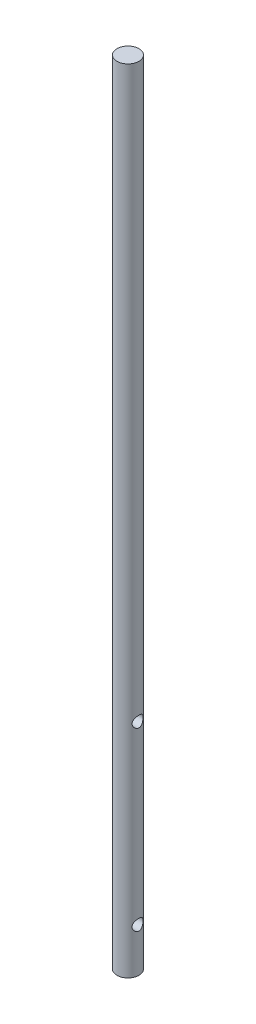
ISO-10303-21;
HEADER;
FILE_DESCRIPTION(('STEP AP214'),'2;1');
FILE_NAME('part.step','',(''),(''),'','','');
FILE_SCHEMA(('AUTOMOTIVE_DESIGN { 1 0 10303 214 1 1 1 1 }'));
ENDSEC;
DATA;
#1=APPLICATION_CONTEXT('core data for automotive mechanical design processes');
#2=APPLICATION_PROTOCOL_DEFINITION('international standard','automotive_design',2000,#1);
#3=PRODUCT_CONTEXT('',#1,'mechanical');
#4=PRODUCT('Part','Part','',(#3));
#5=PRODUCT_RELATED_PRODUCT_CATEGORY('part','',(#4));
#6=PRODUCT_DEFINITION_FORMATION('','',#4);
#7=PRODUCT_DEFINITION_CONTEXT('part definition',#1,'design');
#8=PRODUCT_DEFINITION('design','',#6,#7);
#9=PRODUCT_DEFINITION_SHAPE('','',#8);
#10=(LENGTH_UNIT() NAMED_UNIT(*) SI_UNIT(.MILLI.,.METRE.));
#11=(NAMED_UNIT(*) PLANE_ANGLE_UNIT() SI_UNIT($,.RADIAN.));
#12=(NAMED_UNIT(*) SI_UNIT($,.STERADIAN.) SOLID_ANGLE_UNIT());
#13=UNCERTAINTY_MEASURE_WITH_UNIT(LENGTH_MEASURE(1.E-05),#10,'distance_accuracy_value','');
#14=(GEOMETRIC_REPRESENTATION_CONTEXT(3) GLOBAL_UNCERTAINTY_ASSIGNED_CONTEXT((#13)) GLOBAL_UNIT_ASSIGNED_CONTEXT((#10,
#11,#12)) REPRESENTATION_CONTEXT('',''));
#15=CARTESIAN_POINT('',(0.,0.,0.));
#16=DIRECTION('',(0.,0.,1.));
#17=DIRECTION('',(1.,0.,0.));
#18=AXIS2_PLACEMENT_3D('',#15,#16,#17);
#19=CARTESIAN_POINT('',(0.,457.2,0.));
#20=DIRECTION('',(0.,-1.,0.));
#21=DIRECTION('',(0.,0.,-1.));
#22=AXIS2_PLACEMENT_3D('',#19,#20,#21);
#23=CYLINDRICAL_SURFACE('',#22,6.35);
#24=CARTESIAN_POINT('',(-5.49926131403118,127.,-3.175));
#25=CARTESIAN_POINT('',(-5.49926232876913,127.082761913533,-3.17499905676822));
#26=CARTESIAN_POINT('',(-5.50113815093942,127.165533915042,-3.17175738528249));
#27=CARTESIAN_POINT('',(-5.50856077670455,127.330420212859,-3.15884523354688));
#28=CARTESIAN_POINT('',(-5.51410928932437,127.412534184951,-3.1491717603564));
#29=CARTESIAN_POINT('',(-5.53601678924102,127.657165748411,-3.11062065473092));
#30=CARTESIAN_POINT('',(-5.55763722742636,127.817828046981,-3.07221261154103));
#31=CARTESIAN_POINT('',(-5.61178865498313,128.128597812146,-2.97211747978078));
#32=CARTESIAN_POINT('',(-5.6442615458663,128.278756440186,-2.9105541372517));
#33=CARTESIAN_POINT('',(-5.71635543890045,128.5666114228,-2.76627435445934));
#34=CARTESIAN_POINT('',(-5.75597682772093,128.704307102634,-2.6835567698406));
#35=CARTESIAN_POINT('',(-5.84190034267495,128.97582382134,-2.49131627779833));
#36=CARTESIAN_POINT('',(-5.8884839533831,129.108388597282,-2.38014521787041));
#37=CARTESIAN_POINT('',(-5.98081052060146,129.353970791255,-2.13758083606041));
#38=CARTESIAN_POINT('',(-6.02655304768282,129.466978458905,-2.00617748851799));
#39=CARTESIAN_POINT('',(-6.11573187346573,129.67769095285,-1.71605436473861));
#40=CARTESIAN_POINT('',(-6.15880487346127,129.77385077894,-1.556090325276));
#41=CARTESIAN_POINT('',(-6.2341365114724,129.937322143111,-1.2196985592924));
#42=CARTESIAN_POINT('',(-6.26640197156109,130.004651887186,-1.04328130884116));
#43=CARTESIAN_POINT('',(-6.31445464313237,130.103577314539,-0.692292696730367));
#44=CARTESIAN_POINT('',(-6.33125099630315,130.137374746794,-0.518483183758143));
#45=CARTESIAN_POINT('',(-6.35024078782237,130.175527426178,-0.166911747158822));
#46=CARTESIAN_POINT('',(-6.35244306187831,130.179900487757,0.0108477196167096));
#47=CARTESIAN_POINT('',(-6.34247467450733,130.159929298795,0.348718268640241));
#48=CARTESIAN_POINT('',(-6.33153724004096,130.138049256784,0.509019820270716));
#49=CARTESIAN_POINT('',(-6.29838229153244,130.070603364542,0.823321212955352));
#50=CARTESIAN_POINT('',(-6.27616393341038,130.025035741913,0.977320581525282));
#51=CARTESIAN_POINT('',(-6.22209775234818,129.911212685977,1.27733236684467));
#52=CARTESIAN_POINT('',(-6.19012095460315,129.842652079479,1.42320480220677));
#53=CARTESIAN_POINT('',(-6.11942032404916,129.685214279984,1.70172616219332));
#54=CARTESIAN_POINT('',(-6.08069407688628,129.596329813352,1.83437032813195));
#55=CARTESIAN_POINT('',(-5.99580926070807,129.391104698414,2.09605211974367));
#56=CARTESIAN_POINT('',(-5.94929416927822,129.272962909571,2.22356359612798));
#57=CARTESIAN_POINT('',(-5.85642633307517,129.01743760648,2.45777846555887));
#58=CARTESIAN_POINT('',(-5.81007373990265,128.88003942646,2.56446584928023));
#59=CARTESIAN_POINT('',(-5.71957289604347,128.579052231631,2.76069102698818));
#60=CARTESIAN_POINT('',(-5.67575155752789,128.414354088941,2.84870951352547));
#61=CARTESIAN_POINT('',(-5.61885247415838,128.156162433869,2.95849503046443));
#62=CARTESIAN_POINT('',(-5.60135560040996,128.068222071488,2.99138760520285));
#63=CARTESIAN_POINT('',(-5.56999217748626,127.889202561789,3.04938956554735));
#64=CARTESIAN_POINT('',(-5.55612339050229,127.798125388681,3.07450375064138));
#65=CARTESIAN_POINT('',(-5.53355357587716,127.620848368596,3.11492823782859));
#66=CARTESIAN_POINT('',(-5.52453156228568,127.534829357867,3.13085491331031));
#67=CARTESIAN_POINT('',(-5.51045313491466,127.361489372412,3.15556797554225));
#68=CARTESIAN_POINT('',(-5.50539465890766,127.274169098866,3.16435807553686));
#69=CARTESIAN_POINT('',(-5.49945626530651,127.098984851134,3.17466835867006));
#70=CARTESIAN_POINT('',(-5.49857479177741,127.01112109161,3.17619124884848));
#71=CARTESIAN_POINT('',(-5.50101508803298,126.835655162357,3.17195985852084));
#72=CARTESIAN_POINT('',(-5.50433657410105,126.748052975372,3.16620606921981));
#73=CARTESIAN_POINT('',(-5.51925588435845,126.505907414355,3.14018226453033));
#74=CARTESIAN_POINT('',(-5.53528611699028,126.352394392471,3.11209439281023));
#75=CARTESIAN_POINT('',(-5.57828096923594,126.052653119407,3.03433762958357));
#76=CARTESIAN_POINT('',(-5.60524912972111,125.90642724448,2.98466174914481));
#77=CARTESIAN_POINT('',(-5.6685262578896,125.617577373351,2.86273054239683));
#78=CARTESIAN_POINT('',(-5.70520999770141,125.475433867968,2.78953600385259));
#79=CARTESIAN_POINT('',(-5.78345646913641,125.204632815229,2.62346157669831));
#80=CARTESIAN_POINT('',(-5.82502170218952,125.075982246558,2.53057157570875));
#81=CARTESIAN_POINT('',(-5.91464405440153,124.818843128481,2.31405795861386));
#82=CARTESIAN_POINT('',(-5.96285904289681,124.692419238297,2.18803622695197));
#83=CARTESIAN_POINT('',(-6.05581193279061,124.46186595248,1.91580928554185));
#84=CARTESIAN_POINT('',(-6.10054865642871,124.357744087677,1.7695972853741));
#85=CARTESIAN_POINT('',(-6.18303824145363,124.172428473318,1.45584977269241));
#86=CARTESIAN_POINT('',(-6.22057562531784,124.091912363174,1.28785333421911));
#87=CARTESIAN_POINT('',(-6.28279651772886,123.961087141771,0.938283508313593));
#88=CARTESIAN_POINT('',(-6.30749131056505,123.910751506126,0.756722200806227));
#89=CARTESIAN_POINT('',(-6.33944338582815,123.84605480946,0.403160492410768));
#90=CARTESIAN_POINT('',(-6.34809271326659,123.828816735698,0.231811338563315));
#91=CARTESIAN_POINT('',(-6.35133763722966,123.822322640575,-0.111525009731701));
#92=CARTESIAN_POINT('',(-6.3459381534549,123.833056823714,-0.283511959769329));
#93=CARTESIAN_POINT('',(-6.32250351776756,123.880297059558,-0.611308110350763));
#94=CARTESIAN_POINT('',(-6.30532443151585,123.915058279863,-0.767436553820521));
#95=CARTESIAN_POINT('',(-6.26084894800281,124.007013339334,-1.07139095342118));
#96=CARTESIAN_POINT('',(-6.23355109988091,124.064210395491,-1.21921571544175));
#97=CARTESIAN_POINT('',(-6.16984840144776,124.201957937862,-1.50946910032134));
#98=CARTESIAN_POINT('',(-6.13310397734645,124.283402628126,-1.65139651176321));
#99=CARTESIAN_POINT('',(-6.05434784579293,124.466218154329,-1.92016030444464));
#100=CARTESIAN_POINT('',(-6.01233372232389,124.567598142255,-2.04698971133068));
#101=CARTESIAN_POINT('',(-5.92228494250573,124.799073831295,-2.29524860659571));
#102=CARTESIAN_POINT('',(-5.87406724075614,124.931023231152,-2.41488454123003));
#103=CARTESIAN_POINT('',(-5.78049654064408,125.213933730541,-2.63101905620373));
#104=CARTESIAN_POINT('',(-5.73514610261339,125.364911471258,-2.72749716677431));
#105=CARTESIAN_POINT('',(-5.67271720109895,125.605679481244,-2.85396050304136));
#106=CARTESIAN_POINT('',(-5.6525712359879,125.689757722706,-2.89354057606827));
#107=CARTESIAN_POINT('',(-5.61522862075768,125.861607224518,-2.9653574765472));
#108=CARTESIAN_POINT('',(-5.59803045260694,125.949376554883,-2.99759808643802));
#109=CARTESIAN_POINT('',(-5.56731186793829,126.127769008425,-3.05427194354531));
#110=CARTESIAN_POINT('',(-5.55378200380455,126.21838411683,-3.07872527562276));
#111=CARTESIAN_POINT('',(-5.53094387019911,126.401888478541,-3.11956903021309));
#112=CARTESIAN_POINT('',(-5.52163264949545,126.494776093974,-3.13596509002516));
#113=CARTESIAN_POINT('',(-5.50956192150408,126.656463748796,-3.15710761797221));
#114=CARTESIAN_POINT('',(-5.5057086840578,126.72493367276,-3.16381073091702));
#115=CARTESIAN_POINT('',(-5.50055787263126,126.862266718613,-3.17275746355016));
#116=CARTESIAN_POINT('',(-5.49926046961937,126.931129866497,-3.17500078490812));
#117=CARTESIAN_POINT('',(-5.49926131403118,127.,-3.175));
#118=B_SPLINE_CURVE_WITH_KNOTS('',3,(#24,#25,#26,#27,#28,#29,#30,#31,#32,#33,#34,#35,#36,#37,
#38,#39,#40,#41,#42,#43,#44,#45,#46,#47,#48,#49,#50,#51,#52,#53,#54,#55,#56,#57,#58,#59,#60,#61,
#62,#63,#64,#65,#66,#67,#68,#69,#70,#71,#72,#73,#74,#75,#76,#77,#78,#79,#80,#81,#82,#83,#84,#85,
#86,#87,#88,#89,#90,#91,#92,#93,#94,#95,#96,#97,#98,#99,#100,#101,#102,#103,#104,#105,#106,#107,
#108,#109,#110,#111,#112,#113,#114,#115,#116,#117),.UNSPECIFIED.,.T.,.F.,(4,2,2,2,2,2,2,2,2,2,2,
2,2,2,2,2,2,2,2,2,2,2,2,2,2,2,2,2,2,2,2,2,2,2,2,2,2,2,2,2,2,2,2,2,2,2,4),(0.,0.248210314193387,
0.496536210172837,0.993616655653378,1.48807751301481,1.98256512428755,2.51783706318111,
3.05337510292799,3.62501229957996,4.19628797710276,4.72691486873116,5.25722047303098,
5.7414103161333,6.2256363934284,6.71656194871309,7.20766347537033,7.74518754975547,
8.2831232528071,8.85521994590919,9.14138502893472,9.42737318655796,9.69083660833534,
9.95416285897607,10.2173910127766,10.4806013985705,10.9489167635525,11.4173838546847,
11.907548100733,12.3979646273262,12.9502005485241,13.5026226528976,14.0696241997013,
14.6361266987681,15.1506510247059,15.6649951955482,16.1454469295095,16.6259675788461,
17.1270402751829,17.6283435455375,18.1795366185793,18.7312151251733,19.0161455987001,
19.300928897391,19.5849716229022,19.8688153329579,20.075349152287,20.2818967868888),.UNSPECIFIED.);
#119=CARTESIAN_POINT('',(-5.49926131403118,127.,-3.175));
#120=VERTEX_POINT('',#119);
#121=EDGE_CURVE('E10',#120,#120,#118,.T.);
#122=ORIENTED_EDGE('',*,*,#121,.T.);
#123=EDGE_LOOP('',(#122));
#124=FACE_BOUND('',#123,.T.);
#125=CARTESIAN_POINT('',(5.49926131403119,127.,-3.175));
#126=CARTESIAN_POINT('',(5.49926232876913,126.917238086467,-3.17499905676822));
#127=CARTESIAN_POINT('',(5.50113815093942,126.834466084958,-3.17175738528249));
#128=CARTESIAN_POINT('',(5.50856077670455,126.669579787141,-3.15884523354688));
#129=CARTESIAN_POINT('',(5.51410928932437,126.587465815049,-3.1491717603564));
#130=CARTESIAN_POINT('',(5.53601678924102,126.342834251589,-3.11062065473092));
#131=CARTESIAN_POINT('',(5.55763722742636,126.182171953019,-3.07221261154103));
#132=CARTESIAN_POINT('',(5.61178865498313,125.871402187854,-2.97211747978078));
#133=CARTESIAN_POINT('',(5.6442615458663,125.721243559814,-2.9105541372517));
#134=CARTESIAN_POINT('',(5.71635543890045,125.4333885772,-2.76627435445935));
#135=CARTESIAN_POINT('',(5.75597682772092,125.295692897366,-2.68355676984061));
#136=CARTESIAN_POINT('',(5.84190034267495,125.02417617866,-2.49131627779835));
#137=CARTESIAN_POINT('',(5.88848395338309,124.891611402718,-2.38014521787044));
#138=CARTESIAN_POINT('',(5.98081052060145,124.646029208745,-2.13758083606044));
#139=CARTESIAN_POINT('',(6.02655304768281,124.533021541095,-2.00617748851802));
#140=CARTESIAN_POINT('',(6.11573187346572,124.32230904715,-1.71605436473864));
#141=CARTESIAN_POINT('',(6.15880487346126,124.22614922106,-1.55609032527603));
#142=CARTESIAN_POINT('',(6.23413651147239,124.062677856889,-1.21969855929245));
#143=CARTESIAN_POINT('',(6.26640197156108,123.995348112814,-1.04328130884121));
#144=CARTESIAN_POINT('',(6.31445464313236,123.896422685461,-0.69229269673042));
#145=CARTESIAN_POINT('',(6.33125099630315,123.862625253206,-0.518483183758195));
#146=CARTESIAN_POINT('',(6.35024078782237,123.824472573822,-0.16691174715887));
#147=CARTESIAN_POINT('',(6.35244306187831,123.820099512243,0.0108477196166665));
#148=CARTESIAN_POINT('',(6.34247467450733,123.840070701205,0.348718268640203));
#149=CARTESIAN_POINT('',(6.33153724004097,123.861950743216,0.509019820270679));
#150=CARTESIAN_POINT('',(6.29838229153245,123.929396635458,0.823321212955321));
#151=CARTESIAN_POINT('',(6.27616393341038,123.974964258087,0.977320581525257));
#152=CARTESIAN_POINT('',(6.22209775234818,124.088787314023,1.27733236684466));
#153=CARTESIAN_POINT('',(6.19012095460315,124.157347920521,1.42320480220676));
#154=CARTESIAN_POINT('',(6.11942032404916,124.314785720016,1.70172616219331));
#155=CARTESIAN_POINT('',(6.08069407688628,124.403670186648,1.83437032813194));
#156=CARTESIAN_POINT('',(5.99580926070808,124.608895301586,2.09605211974366));
#157=CARTESIAN_POINT('',(5.94929416927823,124.727037090429,2.22356359612797));
#158=CARTESIAN_POINT('',(5.85642633307518,124.98256239352,2.45777846555886));
#159=CARTESIAN_POINT('',(5.81007373990265,125.11996057354,2.56446584928023));
#160=CARTESIAN_POINT('',(5.71957289604347,125.420947768369,2.76069102698818));
#161=CARTESIAN_POINT('',(5.67575155752789,125.585645911059,2.84870951352547));
#162=CARTESIAN_POINT('',(5.61885247415838,125.843837566131,2.95849503046443));
#163=CARTESIAN_POINT('',(5.60135560040996,125.931777928512,2.99138760520285));
#164=CARTESIAN_POINT('',(5.56999217748626,126.110797438211,3.04938956554735));
#165=CARTESIAN_POINT('',(5.55612339050229,126.201874611319,3.07450375064138));
#166=CARTESIAN_POINT('',(5.53355357587716,126.379151631404,3.11492823782859));
#167=CARTESIAN_POINT('',(5.52453156228568,126.465170642133,3.13085491331031));
#168=CARTESIAN_POINT('',(5.51045313491466,126.638510627588,3.15556797554225));
#169=CARTESIAN_POINT('',(5.50539465890766,126.725830901134,3.16435807553686));
#170=CARTESIAN_POINT('',(5.49945626530651,126.901015148866,3.17466835867006));
#171=CARTESIAN_POINT('',(5.49857479177741,126.98887890839,3.17619124884848));
#172=CARTESIAN_POINT('',(5.50101508803298,127.164344837643,3.17195985852084));
#173=CARTESIAN_POINT('',(5.50433657410105,127.251947024628,3.16620606921981));
#174=CARTESIAN_POINT('',(5.51925588435845,127.494092585645,3.14018226453034));
#175=CARTESIAN_POINT('',(5.53528611699027,127.647605607529,3.11209439281024));
#176=CARTESIAN_POINT('',(5.57828096923592,127.947346880593,3.0343376295836));
#177=CARTESIAN_POINT('',(5.60524912972109,128.09357275552,2.98466174914484));
#178=CARTESIAN_POINT('',(5.66852625788959,128.382422626649,2.86273054239686));
#179=CARTESIAN_POINT('',(5.70520999770139,128.524566132032,2.78953600385262));
#180=CARTESIAN_POINT('',(5.7834564691364,128.795367184771,2.62346157669834));
#181=CARTESIAN_POINT('',(5.8250217021895,128.924017753442,2.53057157570878));
#182=CARTESIAN_POINT('',(5.91464405440152,129.181156871519,2.31405795861388));
#183=CARTESIAN_POINT('',(5.96285904289681,129.307580761703,2.18803622695198));
#184=CARTESIAN_POINT('',(6.0558119327906,129.53813404752,1.91580928554186));
#185=CARTESIAN_POINT('',(6.10054865642871,129.642255912323,1.76959728537412));
#186=CARTESIAN_POINT('',(6.18303824145362,129.827571526682,1.45584977269244));
#187=CARTESIAN_POINT('',(6.22057562531784,129.908087636826,1.28785333421913));
#188=CARTESIAN_POINT('',(6.28279651772886,130.038912858229,0.938283508313602));
#189=CARTESIAN_POINT('',(6.30749131056505,130.089248493874,0.756722200806234));
#190=CARTESIAN_POINT('',(6.33944338582815,130.15394519054,0.403160492410776));
#191=CARTESIAN_POINT('',(6.34809271326659,130.171183264302,0.231811338563327));
#192=CARTESIAN_POINT('',(6.35133763722966,130.177677359425,-0.111525009731683));
#193=CARTESIAN_POINT('',(6.3459381534549,130.166943176286,-0.283511959769307));
#194=CARTESIAN_POINT('',(6.32250351776756,130.119702940442,-0.61130811035074));
#195=CARTESIAN_POINT('',(6.30532443151586,130.084941720137,-0.767436553820498));
#196=CARTESIAN_POINT('',(6.26084894800281,129.992986660666,-1.07139095342115));
#197=CARTESIAN_POINT('',(6.23355109988092,129.935789604509,-1.21921571544172));
#198=CARTESIAN_POINT('',(6.16984840144777,129.798042062138,-1.5094691003213));
#199=CARTESIAN_POINT('',(6.13310397734646,129.716597371874,-1.65139651176318));
#200=CARTESIAN_POINT('',(6.05434784579294,129.533781845671,-1.92016030444461));
#201=CARTESIAN_POINT('',(6.0123337223239,129.432401857745,-2.04698971133065));
#202=CARTESIAN_POINT('',(5.92228494250574,129.200926168705,-2.29524860659568));
#203=CARTESIAN_POINT('',(5.87406724075615,129.068976768848,-2.41488454123001));
#204=CARTESIAN_POINT('',(5.78049654064409,128.786066269459,-2.63101905620371));
#205=CARTESIAN_POINT('',(5.7351461026134,128.635088528742,-2.72749716677428));
#206=CARTESIAN_POINT('',(5.67271720109896,128.394320518756,-2.85396050304133));
#207=CARTESIAN_POINT('',(5.65257123598791,128.310242277294,-2.89354057606825));
#208=CARTESIAN_POINT('',(5.61522862075769,128.138392775482,-2.96535747654717));
#209=CARTESIAN_POINT('',(5.59803045260695,128.050623445117,-2.997598086438));
#210=CARTESIAN_POINT('',(5.5673118679383,127.872230991575,-3.05427194354529));
#211=CARTESIAN_POINT('',(5.55378200380455,127.78161588317,-3.07872527562275));
#212=CARTESIAN_POINT('',(5.53094387019911,127.598111521459,-3.11956903021308));
#213=CARTESIAN_POINT('',(5.52163264949546,127.505223906026,-3.13596509002515));
#214=CARTESIAN_POINT('',(5.50956192150408,127.343536251204,-3.15710761797221));
#215=CARTESIAN_POINT('',(5.5057086840578,127.27506632724,-3.16381073091702));
#216=CARTESIAN_POINT('',(5.50055787263126,127.137733281387,-3.17275746355016));
#217=CARTESIAN_POINT('',(5.49926046961937,127.068870133503,-3.17500078490812));
#218=CARTESIAN_POINT('',(5.49926131403119,127.,-3.175));
#219=B_SPLINE_CURVE_WITH_KNOTS('',3,(#125,#126,#127,#128,#129,#130,#131,#132,#133,#134,#135,
#136,#137,#138,#139,#140,#141,#142,#143,#144,#145,#146,#147,#148,#149,#150,#151,#152,#153,#154,
#155,#156,#157,#158,#159,#160,#161,#162,#163,#164,#165,#166,#167,#168,#169,#170,#171,#172,#173,
#174,#175,#176,#177,#178,#179,#180,#181,#182,#183,#184,#185,#186,#187,#188,#189,#190,#191,#192,
#193,#194,#195,#196,#197,#198,#199,#200,#201,#202,#203,#204,#205,#206,#207,#208,#209,#210,#211,
#212,#213,#214,#215,#216,#217,#218),.UNSPECIFIED.,.T.,.F.,(4,2,2,2,2,2,2,2,2,2,2,2,2,2,2,2,2,2,
2,2,2,2,2,2,2,2,2,2,2,2,2,2,2,2,2,2,2,2,2,2,2,2,2,2,2,2,4),(0.,0.248210314193387,
0.496536210172837,0.993616655653378,1.48807751301481,1.98256512428751,2.51783706318106,
3.05337510292795,3.62501229957991,4.1962879771027,4.72691486873111,5.25722047303094,
5.74141031613326,6.22563639342837,6.71656194871309,7.20766347537031,7.74518754975545,
8.28312325280709,8.85521994590918,9.14138502893472,9.42737318655796,9.69083660833534,
9.95416285897606,10.2173910127766,10.4806013985705,10.9489167635524,11.4173838546846,
11.9075481007329,12.3979646273261,12.9502005485241,13.5026226528975,14.0696241997013,
14.6361266987681,15.1506510247058,15.6649951955482,16.1454469295095,16.625967578846,
17.1270402751829,17.6283435455375,18.1795366185792,18.7312151251733,19.0161455987001,
19.3009288973909,19.5849716229022,19.8688153329579,20.0753491522871,20.2818967868888),.UNSPECIFIED.);
#220=CARTESIAN_POINT('',(5.49926131403119,127.,-3.175));
#221=VERTEX_POINT('',#220);
#222=EDGE_CURVE('E41',#221,#221,#219,.T.);
#223=ORIENTED_EDGE('',*,*,#222,.T.);
#224=EDGE_LOOP('',(#223));
#225=FACE_BOUND('',#224,.T.);
#226=CARTESIAN_POINT('',(-5.49926131403118,25.4,-3.175));
#227=CARTESIAN_POINT('',(-5.49926232876913,25.4827619135325,-3.17499905676822));
#228=CARTESIAN_POINT('',(-5.50113815093942,25.5655339150417,-3.17175738528249));
#229=CARTESIAN_POINT('',(-5.50856077670455,25.7304202128587,-3.15884523354688));
#230=CARTESIAN_POINT('',(-5.51410928932437,25.8125341849508,-3.1491717603564));
#231=CARTESIAN_POINT('',(-5.53601678924102,26.0571657484108,-3.11062065473092));
#232=CARTESIAN_POINT('',(-5.55763722742636,26.217828046981,-3.07221261154103));
#233=CARTESIAN_POINT('',(-5.61178865498313,26.5285978121458,-2.97211747978078));
#234=CARTESIAN_POINT('',(-5.6442615458663,26.6787564401864,-2.91055413725169));
#235=CARTESIAN_POINT('',(-5.71635543890046,26.9666114228,-2.76627435445934));
#236=CARTESIAN_POINT('',(-5.75597682772093,27.1043071026343,-2.6835567698406));
#237=CARTESIAN_POINT('',(-5.84190034267495,27.3758238213397,-2.49131627779834));
#238=CARTESIAN_POINT('',(-5.8884839533831,27.5083885972817,-2.38014521787042));
#239=CARTESIAN_POINT('',(-5.98081052060146,27.7539707912548,-2.13758083606041));
#240=CARTESIAN_POINT('',(-6.02655304768282,27.866978458905,-2.00617748851799));
#241=CARTESIAN_POINT('',(-6.11573187346573,28.0776909528501,-1.7160543647386));
#242=CARTESIAN_POINT('',(-6.15880487346127,28.1738507789397,-1.55609032527599));
#243=CARTESIAN_POINT('',(-6.2341365114724,28.3373221431114,-1.2196985592924));
#244=CARTESIAN_POINT('',(-6.26640197156109,28.404651887186,-1.04328130884116));
#245=CARTESIAN_POINT('',(-6.31445464313237,28.5035773145385,-0.692292696730367));
#246=CARTESIAN_POINT('',(-6.33125099630315,28.5373747467942,-0.518483183758143));
#247=CARTESIAN_POINT('',(-6.35024078782237,28.5755274261782,-0.166911747158821));
#248=CARTESIAN_POINT('',(-6.35244306187831,28.5799004877566,0.0108477196167126));
#249=CARTESIAN_POINT('',(-6.34247467450733,28.5599292987948,0.348718268640244));
#250=CARTESIAN_POINT('',(-6.33153724004096,28.5380492567841,0.509019820270719));
#251=CARTESIAN_POINT('',(-6.29838229153244,28.470603364542,0.823321212955356));
#252=CARTESIAN_POINT('',(-6.27616393341038,28.4250357419134,0.977320581525289));
#253=CARTESIAN_POINT('',(-6.22209775234818,28.3112126859772,1.27733236684468));
#254=CARTESIAN_POINT('',(-6.19012095460315,28.2426520794793,1.42320480220678));
#255=CARTESIAN_POINT('',(-6.11942032404915,28.0852142799841,1.70172616219333));
#256=CARTESIAN_POINT('',(-6.08069407688628,27.9963298133523,1.83437032813196));
#257=CARTESIAN_POINT('',(-5.99580926070807,27.791104698414,2.09605211974368));
#258=CARTESIAN_POINT('',(-5.94929416927822,27.6729629095709,2.22356359612798));
#259=CARTESIAN_POINT('',(-5.85642633307517,27.4174376064798,2.45777846555888));
#260=CARTESIAN_POINT('',(-5.81007373990264,27.2800394264604,2.56446584928025));
#261=CARTESIAN_POINT('',(-5.71957289604346,26.9790522316311,2.76069102698819));
#262=CARTESIAN_POINT('',(-5.67575155752788,26.8143540889413,2.84870951352548));
#263=CARTESIAN_POINT('',(-5.61885247415838,26.5561624338692,2.95849503046444));
#264=CARTESIAN_POINT('',(-5.60135560040996,26.4682220714883,2.99138760520286));
#265=CARTESIAN_POINT('',(-5.56999217748626,26.2892025617885,3.04938956554736));
#266=CARTESIAN_POINT('',(-5.55612339050229,26.1981253886808,3.07450375064138));
#267=CARTESIAN_POINT('',(-5.53355357587715,26.0208483685962,3.11492823782859));
#268=CARTESIAN_POINT('',(-5.52453156228567,25.9348293578666,3.13085491331032));
#269=CARTESIAN_POINT('',(-5.51045313491466,25.7614893724119,3.15556797554225));
#270=CARTESIAN_POINT('',(-5.50539465890766,25.6741690988663,3.16435807553686));
#271=CARTESIAN_POINT('',(-5.49945626530651,25.4989848511338,3.17466835867007));
#272=CARTESIAN_POINT('',(-5.49857479177741,25.4111210916096,3.17619124884848));
#273=CARTESIAN_POINT('',(-5.50101508803298,25.2356551623574,3.17195985852084));
#274=CARTESIAN_POINT('',(-5.50433657410105,25.1480529753723,3.16620606921981));
#275=CARTESIAN_POINT('',(-5.51925588435845,24.9059074143548,3.14018226453033));
#276=CARTESIAN_POINT('',(-5.53528611699027,24.7523943924713,3.11209439281023));
#277=CARTESIAN_POINT('',(-5.57828096923593,24.4526531194066,3.03433762958358));
#278=CARTESIAN_POINT('',(-5.6052491297211,24.3064272444796,2.98466174914482));
#279=CARTESIAN_POINT('',(-5.66852625788959,24.0175773733514,2.86273054239683));
#280=CARTESIAN_POINT('',(-5.7052099977014,23.8754338679681,2.7895360038526));
#281=CARTESIAN_POINT('',(-5.78345646913641,23.6046328152292,2.62346157669831));
#282=CARTESIAN_POINT('',(-5.82502170218952,23.4759822465578,2.53057157570875));
#283=CARTESIAN_POINT('',(-5.91464405440153,23.2188431284813,2.31405795861385));
#284=CARTESIAN_POINT('',(-5.96285904289681,23.0924192382975,2.18803622695196));
#285=CARTESIAN_POINT('',(-6.05581193279061,22.8618659524796,1.91580928554184));
#286=CARTESIAN_POINT('',(-6.10054865642871,22.7577440876767,1.76959728537409));
#287=CARTESIAN_POINT('',(-6.18303824145363,22.5724284733179,1.45584977269241));
#288=CARTESIAN_POINT('',(-6.22057562531784,22.4919123631737,1.28785333421911));
#289=CARTESIAN_POINT('',(-6.28279651772886,22.3610871417713,0.938283508313587));
#290=CARTESIAN_POINT('',(-6.30749131056505,22.3107515061256,0.756722200806222));
#291=CARTESIAN_POINT('',(-6.33944338582815,22.2460548094597,0.403160492410765));
#292=CARTESIAN_POINT('',(-6.34809271326659,22.2288167356982,0.231811338563312));
#293=CARTESIAN_POINT('',(-6.35133763722966,22.2223226405745,-0.111525009731705));
#294=CARTESIAN_POINT('',(-6.3459381534549,22.2330568237145,-0.283511959769333));
#295=CARTESIAN_POINT('',(-6.32250351776756,22.280297059558,-0.611308110350771));
#296=CARTESIAN_POINT('',(-6.30532443151585,22.3150582798628,-0.76743655382053));
#297=CARTESIAN_POINT('',(-6.2608489480028,22.4070133393339,-1.07139095342119));
#298=CARTESIAN_POINT('',(-6.23355109988091,22.4642103954908,-1.21921571544175));
#299=CARTESIAN_POINT('',(-6.16984840144776,22.6019579378623,-1.50946910032134));
#300=CARTESIAN_POINT('',(-6.13310397734645,22.6834026281259,-1.65139651176321));
#301=CARTESIAN_POINT('',(-6.05434784579293,22.8662181543294,-1.92016030444465));
#302=CARTESIAN_POINT('',(-6.01233372232389,22.9675981422548,-2.04698971133069));
#303=CARTESIAN_POINT('',(-5.92228494250572,23.1990738312951,-2.29524860659571));
#304=CARTESIAN_POINT('',(-5.87406724075614,23.3310232311521,-2.41488454123003));
#305=CARTESIAN_POINT('',(-5.78049654064407,23.6139337305409,-2.63101905620373));
#306=CARTESIAN_POINT('',(-5.73514610261338,23.7649114712579,-2.72749716677432));
#307=CARTESIAN_POINT('',(-5.67271720109895,24.0056794812444,-2.85396050304136));
#308=CARTESIAN_POINT('',(-5.6525712359879,24.0897577227064,-2.89354057606827));
#309=CARTESIAN_POINT('',(-5.61522862075768,24.2616072245176,-2.96535747654719));
#310=CARTESIAN_POINT('',(-5.59803045260693,24.3493765548833,-2.99759808643802));
#311=CARTESIAN_POINT('',(-5.56731186793829,24.5277690084247,-3.05427194354531));
#312=CARTESIAN_POINT('',(-5.55378200380454,24.6183841168305,-3.07872527562276));
#313=CARTESIAN_POINT('',(-5.53094387019911,24.801888478541,-3.11956903021309));
#314=CARTESIAN_POINT('',(-5.52163264949545,24.8947760939744,-3.13596509002516));
#315=CARTESIAN_POINT('',(-5.50956192150408,25.056463748796,-3.15710761797221));
#316=CARTESIAN_POINT('',(-5.5057086840578,25.1249336727599,-3.16381073091703));
#317=CARTESIAN_POINT('',(-5.50055787263126,25.262266718613,-3.17275746355017));
#318=CARTESIAN_POINT('',(-5.49926046961937,25.3311298664972,-3.17500078490813));
#319=CARTESIAN_POINT('',(-5.49926131403118,25.4,-3.175));
#320=B_SPLINE_CURVE_WITH_KNOTS('',3,(#226,#227,#228,#229,#230,#231,#232,#233,#234,#235,#236,
#237,#238,#239,#240,#241,#242,#243,#244,#245,#246,#247,#248,#249,#250,#251,#252,#253,#254,#255,
#256,#257,#258,#259,#260,#261,#262,#263,#264,#265,#266,#267,#268,#269,#270,#271,#272,#273,#274,
#275,#276,#277,#278,#279,#280,#281,#282,#283,#284,#285,#286,#287,#288,#289,#290,#291,#292,#293,
#294,#295,#296,#297,#298,#299,#300,#301,#302,#303,#304,#305,#306,#307,#308,#309,#310,#311,#312,
#313,#314,#315,#316,#317,#318,#319),.UNSPECIFIED.,.T.,.F.,(4,2,2,2,2,2,2,2,2,2,2,2,2,2,2,2,2,2,
2,2,2,2,2,2,2,2,2,2,2,2,2,2,2,2,2,2,2,2,2,2,2,2,2,2,2,2,4),(0.,0.248210314193369,
0.496536210172848,0.993616655653385,1.48807751301482,1.98256512428755,2.5178370631811,
3.05337510292799,3.62501229957995,4.19628797710276,4.72691486873116,5.25722047303098,
5.7414103161333,6.2256363934284,6.71656194871311,7.20766347537033,7.74518754975548,
8.28312325280711,8.8552199459092,9.14138502893471,9.42737318655799,9.69083660833538,
9.95416285897609,10.2173910127767,10.4806013985705,10.9489167635525,11.4173838546847,
11.9075481007329,12.3979646273262,12.9502005485241,13.5026226528976,14.0696241997013,
14.6361266987681,15.1506510247059,15.6649951955483,16.1454469295095,16.6259675788461,
17.1270402751829,17.6283435455375,18.1795366185793,18.7312151251733,19.0161455987001,
19.300928897391,19.5849716229023,19.8688153329579,20.075349152287,20.2818967868888),.UNSPECIFIED.);
#321=CARTESIAN_POINT('',(-5.49926131403118,25.4,-3.175));
#322=VERTEX_POINT('',#321);
#323=EDGE_CURVE('E45',#322,#322,#320,.T.);
#324=ORIENTED_EDGE('',*,*,#323,.T.);
#325=EDGE_LOOP('',(#324));
#326=FACE_BOUND('',#325,.T.);
#327=CARTESIAN_POINT('',(5.49926131403119,25.4,-3.175));
#328=CARTESIAN_POINT('',(5.49926232876913,25.3172380864675,-3.17499905676822));
#329=CARTESIAN_POINT('',(5.50113815093942,25.2344660849583,-3.17175738528249));
#330=CARTESIAN_POINT('',(5.50856077670455,25.0695797871413,-3.15884523354688));
#331=CARTESIAN_POINT('',(5.51410928932437,24.9874658150492,-3.1491717603564));
#332=CARTESIAN_POINT('',(5.53601678924102,24.7428342515892,-3.11062065473092));
#333=CARTESIAN_POINT('',(5.55763722742636,24.582171953019,-3.07221261154103));
#334=CARTESIAN_POINT('',(5.61178865498313,24.2714021878542,-2.97211747978078));
#335=CARTESIAN_POINT('',(5.6442615458663,24.1212435598136,-2.9105541372517));
#336=CARTESIAN_POINT('',(5.71635543890045,23.8333885772,-2.76627435445934));
#337=CARTESIAN_POINT('',(5.75597682772092,23.6956928973657,-2.68355676984061));
#338=CARTESIAN_POINT('',(5.84190034267494,23.4241761786603,-2.49131627779835));
#339=CARTESIAN_POINT('',(5.88848395338309,23.2916114027183,-2.38014521787044));
#340=CARTESIAN_POINT('',(5.98081052060145,23.0460292087452,-2.13758083606044));
#341=CARTESIAN_POINT('',(6.02655304768281,22.933021541095,-2.00617748851802));
#342=CARTESIAN_POINT('',(6.11573187346572,22.72230904715,-1.71605436473865));
#343=CARTESIAN_POINT('',(6.15880487346126,22.6261492210604,-1.55609032527604));
#344=CARTESIAN_POINT('',(6.23413651147239,22.4626778568886,-1.21969855929246));
#345=CARTESIAN_POINT('',(6.26640197156108,22.395348112814,-1.04328130884122));
#346=CARTESIAN_POINT('',(6.31445464313236,22.2964226854615,-0.692292696730431));
#347=CARTESIAN_POINT('',(6.33125099630315,22.2626252532058,-0.518483183758206));
#348=CARTESIAN_POINT('',(6.35024078782237,22.2244725738218,-0.166911747158881));
#349=CARTESIAN_POINT('',(6.35244306187831,22.2200995122434,0.010847719616654));
#350=CARTESIAN_POINT('',(6.34247467450733,22.2400707012052,0.34871826864019));
#351=CARTESIAN_POINT('',(6.33153724004097,22.2619507432159,0.509019820270667));
#352=CARTESIAN_POINT('',(6.29838229153245,22.3293966354579,0.823321212955311));
#353=CARTESIAN_POINT('',(6.27616393341038,22.3749642580866,0.977320581525248));
#354=CARTESIAN_POINT('',(6.22209775234818,22.4887873140228,1.27733236684465));
#355=CARTESIAN_POINT('',(6.19012095460316,22.5573479205207,1.42320480220675));
#356=CARTESIAN_POINT('',(6.11942032404916,22.7147857200159,1.7017261621933));
#357=CARTESIAN_POINT('',(6.08069407688629,22.8036701866477,1.83437032813193));
#358=CARTESIAN_POINT('',(5.99580926070808,23.008895301586,2.09605211974366));
#359=CARTESIAN_POINT('',(5.94929416927823,23.1270370904291,2.22356359612796));
#360=CARTESIAN_POINT('',(5.85642633307518,23.3825623935202,2.45777846555886));
#361=CARTESIAN_POINT('',(5.81007373990265,23.5199605735396,2.56446584928023));
#362=CARTESIAN_POINT('',(5.71957289604347,23.8209477683689,2.76069102698817));
#363=CARTESIAN_POINT('',(5.67575155752789,23.9856459110587,2.84870951352546));
#364=CARTESIAN_POINT('',(5.61885247415839,24.2438375661308,2.95849503046442));
#365=CARTESIAN_POINT('',(5.60135560040997,24.3317779285117,2.99138760520284));
#366=CARTESIAN_POINT('',(5.56999217748627,24.5107974382114,3.04938956554735));
#367=CARTESIAN_POINT('',(5.55612339050229,24.6018746113191,3.07450375064137));
#368=CARTESIAN_POINT('',(5.53355357587716,24.7791516314037,3.11492823782858));
#369=CARTESIAN_POINT('',(5.52453156228568,24.8651706421334,3.13085491331031));
#370=CARTESIAN_POINT('',(5.51045313491466,25.038510627588,3.15556797554224));
#371=CARTESIAN_POINT('',(5.50539465890766,25.1258309011336,3.16435807553686));
#372=CARTESIAN_POINT('',(5.49945626530651,25.3010151488662,3.17466835867007));
#373=CARTESIAN_POINT('',(5.49857479177741,25.3888789083904,3.17619124884848));
#374=CARTESIAN_POINT('',(5.50101508803298,25.5643448376426,3.17195985852084));
#375=CARTESIAN_POINT('',(5.50433657410105,25.6519470246276,3.16620606921982));
#376=CARTESIAN_POINT('',(5.51925588435845,25.8940925856452,3.14018226453034));
#377=CARTESIAN_POINT('',(5.53528611699026,26.0476056075286,3.11209439281024));
#378=CARTESIAN_POINT('',(5.57828096923592,26.3473468805933,3.03433762958361));
#379=CARTESIAN_POINT('',(5.60524912972109,26.4935727555203,2.98466174914484));
#380=CARTESIAN_POINT('',(5.66852625788958,26.7824226266486,2.86273054239686));
#381=CARTESIAN_POINT('',(5.70520999770139,26.9245661320318,2.78953600385263));
#382=CARTESIAN_POINT('',(5.78345646913639,27.1953671847707,2.62346157669834));
#383=CARTESIAN_POINT('',(5.8250217021895,27.3240177534421,2.53057157570878));
#384=CARTESIAN_POINT('',(5.91464405440152,27.5811568715187,2.31405795861389));
#385=CARTESIAN_POINT('',(5.9628590428968,27.7075807617025,2.188036226952));
#386=CARTESIAN_POINT('',(6.0558119327906,27.9381340475204,1.91580928554188));
#387=CARTESIAN_POINT('',(6.1005486564287,28.0422559123232,1.76959728537413));
#388=CARTESIAN_POINT('',(6.18303824145362,28.2275715266821,1.45584977269244));
#389=CARTESIAN_POINT('',(6.22057562531784,28.3080876368263,1.28785333421914));
#390=CARTESIAN_POINT('',(6.28279651772885,28.4389128582287,0.93828350831362));
#391=CARTESIAN_POINT('',(6.30749131056505,28.4892484938744,0.756722200806255));
#392=CARTESIAN_POINT('',(6.33944338582815,28.5539451905403,0.403160492410798));
#393=CARTESIAN_POINT('',(6.34809271326659,28.5711832643018,0.231811338563345));
#394=CARTESIAN_POINT('',(6.35133763722966,28.5776773594255,-0.11152500973167));
#395=CARTESIAN_POINT('',(6.3459381534549,28.5669431762855,-0.283511959769296));
#396=CARTESIAN_POINT('',(6.32250351776756,28.519702940442,-0.611308110350731));
#397=CARTESIAN_POINT('',(6.30532443151586,28.4849417201372,-0.767436553820489));
#398=CARTESIAN_POINT('',(6.26084894800281,28.3929866606661,-1.07139095342115));
#399=CARTESIAN_POINT('',(6.23355109988092,28.3357896045092,-1.21921571544171));
#400=CARTESIAN_POINT('',(6.16984840144777,28.1980420621378,-1.50946910032129));
#401=CARTESIAN_POINT('',(6.13310397734646,28.1165973718741,-1.65139651176317));
#402=CARTESIAN_POINT('',(6.05434784579294,27.9337818456707,-1.9201603044446));
#403=CARTESIAN_POINT('',(6.01233372232391,27.8324018577453,-2.04698971133064));
#404=CARTESIAN_POINT('',(5.92228494250574,27.6009261687049,-2.29524860659567));
#405=CARTESIAN_POINT('',(5.87406724075615,27.468976768848,-2.41488454122999));
#406=CARTESIAN_POINT('',(5.78049654064409,27.1860662694591,-2.6310190562037));
#407=CARTESIAN_POINT('',(5.7351461026134,27.0350885287421,-2.72749716677428));
#408=CARTESIAN_POINT('',(5.67271720109897,26.7943205187557,-2.85396050304133));
#409=CARTESIAN_POINT('',(5.65257123598792,26.7102422772936,-2.89354057606824));
#410=CARTESIAN_POINT('',(5.61522862075769,26.5383927754825,-2.96535747654717));
#411=CARTESIAN_POINT('',(5.59803045260695,26.4506234451167,-2.997598086438));
#412=CARTESIAN_POINT('',(5.5673118679383,26.2722309915754,-3.0542719435453));
#413=CARTESIAN_POINT('',(5.55378200380455,26.1816158831696,-3.07872527562275));
#414=CARTESIAN_POINT('',(5.53094387019911,25.9981115214591,-3.11956903021308));
#415=CARTESIAN_POINT('',(5.52163264949546,25.9052239060257,-3.13596509002515));
#416=CARTESIAN_POINT('',(5.50956192150408,25.7435362512041,-3.15710761797221));
#417=CARTESIAN_POINT('',(5.5057086840578,25.6750663272401,-3.16381073091702));
#418=CARTESIAN_POINT('',(5.50055787263126,25.537733281387,-3.17275746355016));
#419=CARTESIAN_POINT('',(5.49926046961937,25.4688701335028,-3.17500078490813));
#420=CARTESIAN_POINT('',(5.49926131403119,25.4,-3.175));
#421=B_SPLINE_CURVE_WITH_KNOTS('',3,(#327,#328,#329,#330,#331,#332,#333,#334,#335,#336,#337,
#338,#339,#340,#341,#342,#343,#344,#345,#346,#347,#348,#349,#350,#351,#352,#353,#354,#355,#356,
#357,#358,#359,#360,#361,#362,#363,#364,#365,#366,#367,#368,#369,#370,#371,#372,#373,#374,#375,
#376,#377,#378,#379,#380,#381,#382,#383,#384,#385,#386,#387,#388,#389,#390,#391,#392,#393,#394,
#395,#396,#397,#398,#399,#400,#401,#402,#403,#404,#405,#406,#407,#408,#409,#410,#411,#412,#413,
#414,#415,#416,#417,#418,#419,#420),.UNSPECIFIED.,.T.,.F.,(4,2,2,2,2,2,2,2,2,2,2,2,2,2,2,2,2,2,
2,2,2,2,2,2,2,2,2,2,2,2,2,2,2,2,2,2,2,2,2,2,2,2,2,2,2,2,4),(0.,0.248210314193369,
0.496536210172844,0.993616655653374,1.48807751301481,1.98256512428752,2.51783706318106,
3.05337510292794,3.62501229957989,4.19628797710269,4.72691486873109,5.25722047303092,
5.74141031613325,6.22563639342836,6.71656194871307,7.2076634753703,7.74518754975544,
8.28312325280708,8.85521994590915,9.14138502893467,9.42737318655794,9.69083660833533,
9.95416285897604,10.2173910127766,10.4806013985704,10.9489167635524,11.4173838546846,
11.9075481007329,12.3979646273261,12.9502005485241,13.5026226528975,14.0696241997013,
14.6361266987681,15.1506510247058,15.6649951955482,16.1454469295095,16.625967578846,
17.1270402751828,17.6283435455374,18.1795366185792,18.7312151251732,19.0161455987001,
19.3009288973909,19.5849716229022,19.8688153329579,20.075349152287,20.2818967868888),.UNSPECIFIED.);
#422=CARTESIAN_POINT('',(5.49926131403119,25.4,-3.175));
#423=VERTEX_POINT('',#422);
#424=EDGE_CURVE('E49',#423,#423,#421,.T.);
#425=ORIENTED_EDGE('',*,*,#424,.T.);
#426=EDGE_LOOP('',(#425));
#427=FACE_BOUND('',#426,.T.);
#428=CARTESIAN_POINT('',(0.,457.2,0.));
#429=DIRECTION('',(0.,1.,0.));
#430=DIRECTION('',(0.,0.,1.));
#431=AXIS2_PLACEMENT_3D('',#428,#429,#430);
#432=CIRCLE('',#431,6.35);
#433=CARTESIAN_POINT('',(0.,457.2,6.35));
#434=VERTEX_POINT('',#433);
#435=EDGE_CURVE('E74',#434,#434,#432,.T.);
#436=ORIENTED_EDGE('',*,*,#435,.F.);
#437=EDGE_LOOP('',(#436));
#438=FACE_BOUND('',#437,.T.);
#439=CARTESIAN_POINT('',(0.,0.,0.));
#440=DIRECTION('',(0.,1.,0.));
#441=DIRECTION('',(0.,0.,1.));
#442=AXIS2_PLACEMENT_3D('',#439,#440,#441);
#443=CIRCLE('',#442,6.35);
#444=CARTESIAN_POINT('',(0.,0.,6.35));
#445=VERTEX_POINT('',#444);
#446=EDGE_CURVE('E75',#445,#445,#443,.T.);
#447=ORIENTED_EDGE('',*,*,#446,.T.);
#448=EDGE_LOOP('',(#447));
#449=FACE_BOUND('',#448,.T.);
#450=ADVANCED_FACE('F31',(#124,#225,#326,#427,#438,#449),#23,.T.);
#451=CARTESIAN_POINT('',(0.,457.2,0.));
#452=DIRECTION('',(0.,1.,0.));
#453=DIRECTION('',(0.,0.,1.));
#454=AXIS2_PLACEMENT_3D('',#451,#452,#453);
#455=PLANE('',#454);
#456=ORIENTED_EDGE('',*,*,#435,.T.);
#457=EDGE_LOOP('',(#456));
#458=FACE_BOUND('',#457,.T.);
#459=ADVANCED_FACE('F68',(#458),#455,.T.);
#460=CARTESIAN_POINT('',(0.,0.,0.));
#461=DIRECTION('',(0.,1.,0.));
#462=DIRECTION('',(0.,0.,1.));
#463=AXIS2_PLACEMENT_3D('',#460,#461,#462);
#464=PLANE('',#463);
#465=ORIENTED_EDGE('',*,*,#446,.F.);
#466=EDGE_LOOP('',(#465));
#467=FACE_BOUND('',#466,.T.);
#468=ADVANCED_FACE('F66',(#467),#464,.F.);
#469=CARTESIAN_POINT('',(-6.35,25.4,0.));
#470=DIRECTION('',(1.,0.,0.));
#471=DIRECTION('',(0.,0.,-1.));
#472=AXIS2_PLACEMENT_3D('',#469,#470,#471);
#473=CYLINDRICAL_SURFACE('',#472,3.175);
#474=ORIENTED_EDGE('',*,*,#424,.F.);
#475=EDGE_LOOP('',(#474));
#476=FACE_BOUND('',#475,.T.);
#477=ORIENTED_EDGE('',*,*,#323,.F.);
#478=EDGE_LOOP('',(#477));
#479=FACE_BOUND('',#478,.T.);
#480=ADVANCED_FACE('F60',(#476,#479),#473,.F.);
#481=CARTESIAN_POINT('',(-6.35,127.,0.));
#482=DIRECTION('',(1.,0.,0.));
#483=DIRECTION('',(0.,0.,-1.));
#484=AXIS2_PLACEMENT_3D('',#481,#482,#483);
#485=CYLINDRICAL_SURFACE('',#484,3.175);
#486=ORIENTED_EDGE('',*,*,#222,.F.);
#487=EDGE_LOOP('',(#486));
#488=FACE_BOUND('',#487,.T.);
#489=ORIENTED_EDGE('',*,*,#121,.F.);
#490=EDGE_LOOP('',(#489));
#491=FACE_BOUND('',#490,.T.);
#492=ADVANCED_FACE('F57',(#488,#491),#485,.F.);
#493=CLOSED_SHELL('',(#450,#459,#468,#480,#492));
#494=MANIFOLD_SOLID_BREP('B2',#493);
#495=ADVANCED_BREP_SHAPE_REPRESENTATION('',(#18,#494),#14);
#496=SHAPE_DEFINITION_REPRESENTATION(#9,#495);
ENDSEC;
END-ISO-10303-21;
